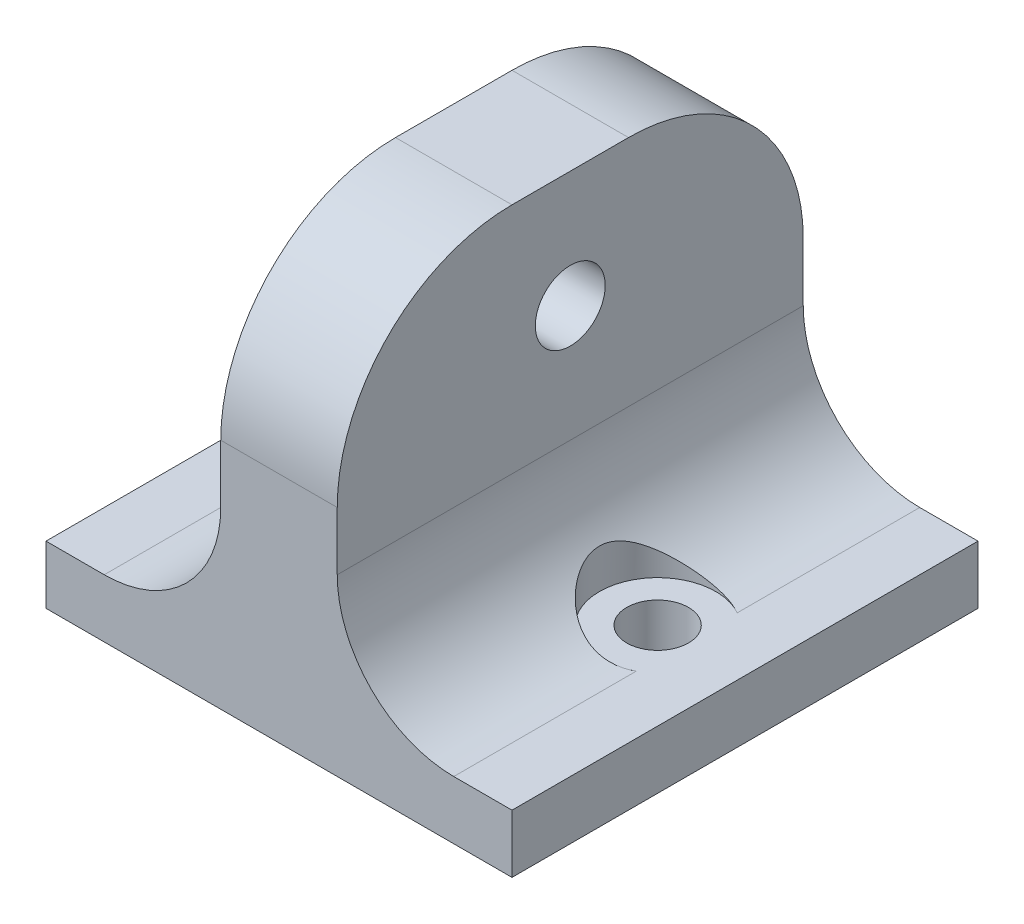
ISO-10303-21;
HEADER;
FILE_DESCRIPTION(('STEP AP214'),'2;1');
FILE_NAME('part.step','',(''),(''),'','','');
FILE_SCHEMA(('AUTOMOTIVE_DESIGN { 1 0 10303 214 1 1 1 1 }'));
ENDSEC;
DATA;
#1=APPLICATION_CONTEXT('core data for automotive mechanical design processes');
#2=APPLICATION_PROTOCOL_DEFINITION('international standard','automotive_design',2000,#1);
#3=PRODUCT_CONTEXT('',#1,'mechanical');
#4=PRODUCT('Part','Part','',(#3));
#5=PRODUCT_RELATED_PRODUCT_CATEGORY('part','',(#4));
#6=PRODUCT_DEFINITION_FORMATION('','',#4);
#7=PRODUCT_DEFINITION_CONTEXT('part definition',#1,'design');
#8=PRODUCT_DEFINITION('design','',#6,#7);
#9=PRODUCT_DEFINITION_SHAPE('','',#8);
#10=(LENGTH_UNIT() NAMED_UNIT(*) SI_UNIT(.MILLI.,.METRE.));
#11=(NAMED_UNIT(*) PLANE_ANGLE_UNIT() SI_UNIT($,.RADIAN.));
#12=(NAMED_UNIT(*) SI_UNIT($,.STERADIAN.) SOLID_ANGLE_UNIT());
#13=UNCERTAINTY_MEASURE_WITH_UNIT(LENGTH_MEASURE(1.E-05),#10,'distance_accuracy_value','');
#14=(GEOMETRIC_REPRESENTATION_CONTEXT(3) GLOBAL_UNCERTAINTY_ASSIGNED_CONTEXT((#13)) GLOBAL_UNIT_ASSIGNED_CONTEXT((#10,
#11,#12)) REPRESENTATION_CONTEXT('',''));
#15=CARTESIAN_POINT('',(0.,0.,0.));
#16=DIRECTION('',(0.,0.,1.));
#17=DIRECTION('',(1.,0.,0.));
#18=AXIS2_PLACEMENT_3D('',#15,#16,#17);
#19=CARTESIAN_POINT('',(15.,15.,20.));
#20=DIRECTION('',(0.,0.,-1.));
#21=DIRECTION('',(-1.,0.,0.));
#22=AXIS2_PLACEMENT_3D('',#19,#20,#21);
#23=CYLINDRICAL_SURFACE('',#22,10.);
#24=CARTESIAN_POINT('',(15.,5.,-4.3301270189222));
#25=CARTESIAN_POINT('',(14.8882386554781,4.99998445902274,-4.39467497557475));
#26=CARTESIAN_POINT('',(14.7739502263457,5.00187289688508,-4.45486764220656));
#27=CARTESIAN_POINT('',(14.5411776825015,5.00985678721763,-4.56620053854316));
#28=CARTESIAN_POINT('',(14.42269321766,5.01595259155152,-4.61734001067632));
#29=CARTESIAN_POINT('',(14.1826843035769,5.03273095738728,-4.71010620780674));
#30=CARTESIAN_POINT('',(14.0611675298457,5.04340286406892,-4.75175468840085));
#31=CARTESIAN_POINT('',(13.8157825421019,5.06959990142405,-4.82546611328692));
#32=CARTESIAN_POINT('',(13.6919145078616,5.08512466245134,-4.85752978729829));
#33=CARTESIAN_POINT('',(13.442663257165,5.12120575780032,-4.91199311729352));
#34=CARTESIAN_POINT('',(13.3172786541474,5.14176708942512,-4.9343831136626));
#35=CARTESIAN_POINT('',(13.0660426757909,5.18796002482518,-4.96947583630976));
#36=CARTESIAN_POINT('',(12.9401911435775,5.21359351983537,-4.98217494058438));
#37=CARTESIAN_POINT('',(12.6890702901284,5.26983289797169,-4.99800692406048));
#38=CARTESIAN_POINT('',(12.5638007078504,5.30043627315325,-5.00114461252506));
#39=CARTESIAN_POINT('',(12.3146058946927,5.36645013703068,-4.99811611266615));
#40=CARTESIAN_POINT('',(12.1906811982888,5.40186246639187,-4.99194635265744));
#41=CARTESIAN_POINT('',(11.9438958181217,5.47755139114533,-4.97053547828674));
#42=CARTESIAN_POINT('',(11.8210547183623,5.51786885801558,-4.95521330313223));
#43=CARTESIAN_POINT('',(11.5782561198452,5.60275343474998,-4.91584511122549));
#44=CARTESIAN_POINT('',(11.458299670397,5.64732206257535,-4.89179596967627));
#45=CARTESIAN_POINT('',(11.1036666935,5.78680572870925,-4.80720829959719));
#46=CARTESIAN_POINT('',(10.8741243109507,5.88753021950668,-4.73422005499128));
#47=CARTESIAN_POINT('',(10.4066319862622,6.11314613895848,-4.54845387781365));
#48=CARTESIAN_POINT('',(10.1708684173466,6.23948661008222,-4.43200579694301));
#49=CARTESIAN_POINT('',(9.7237129240917,6.50129806304623,-4.16652317086487));
#50=CARTESIAN_POINT('',(9.51234610001837,6.63677822509907,-4.01745551395287));
#51=CARTESIAN_POINT('',(9.19874806367569,6.85351098714008,-3.75821930389248));
#52=CARTESIAN_POINT('',(9.08772444898948,6.93385055803025,-3.65770366333628));
#53=CARTESIAN_POINT('',(8.87495331932355,7.0942092504585,-3.44694944624872));
#54=CARTESIAN_POINT('',(8.77320789010567,7.17422829609518,-3.33670869438988));
#55=CARTESIAN_POINT('',(8.57945897995814,7.33238715753747,-3.10676055742636));
#56=CARTESIAN_POINT('',(8.48745351404456,7.41052735373011,-2.98705510992714));
#57=CARTESIAN_POINT('',(8.31373504609715,7.56311658194494,-2.73828252034154));
#58=CARTESIAN_POINT('',(8.23201816602244,7.63756699828803,-2.60921893466744));
#59=CARTESIAN_POINT('',(8.04702621515732,7.81123675186426,-2.28457947505446));
#60=CARTESIAN_POINT('',(7.94940234396886,7.90749239303424,-2.08409613424456));
#61=CARTESIAN_POINT('',(7.77986212859192,8.08015208607802,-1.66469881137546));
#62=CARTESIAN_POINT('',(7.70789245105711,8.15659723118592,-1.44582424873336));
#63=CARTESIAN_POINT('',(7.60476755929538,8.26834201402342,-1.0355965473535));
#64=CARTESIAN_POINT('',(7.56844523859573,8.30870902075786,-0.846959267936247));
#65=CARTESIAN_POINT('',(7.51775975014223,8.36542447034214,-0.463257777180532));
#66=CARTESIAN_POINT('',(7.50337186978507,8.38179994262366,-0.268201051961923));
#67=CARTESIAN_POINT('',(7.49768003079177,8.38825085219856,0.123159524611976));
#68=CARTESIAN_POINT('',(7.50642945311698,8.37826547144377,0.319465215692312));
#69=CARTESIAN_POINT('',(7.54638064350427,8.33333681248906,0.706893995718618));
#70=CARTESIAN_POINT('',(7.57760536903189,8.29836801517505,0.898011577952599));
#71=CARTESIAN_POINT('',(7.67072752183493,8.1965023187875,1.31722703941873));
#72=CARTESIAN_POINT('',(7.73834596884302,8.12380473462324,1.54260804353444));
#73=CARTESIAN_POINT('',(7.90067535691012,7.95634285466991,1.97478863103345));
#74=CARTESIAN_POINT('',(7.99544977381622,7.86152695598049,2.18154316995849));
#75=CARTESIAN_POINT('',(8.17527792922302,7.69017718282131,2.51407179852844));
#76=CARTESIAN_POINT('',(8.25421460154454,7.61710640400181,2.64505888301143));
#77=CARTESIAN_POINT('',(8.42247654295923,7.46681364398052,2.89773190333771));
#78=CARTESIAN_POINT('',(8.51180551759454,7.38959018738542,3.01941449572691));
#79=CARTESIAN_POINT('',(8.70031130287036,7.23282730391278,3.25345371557601));
#80=CARTESIAN_POINT('',(8.7994957546746,7.15328611435021,3.36580298083358));
#81=CARTESIAN_POINT('',(9.00722922774176,6.99351091755676,3.58090807713066));
#82=CARTESIAN_POINT('',(9.11577716060494,6.91327699182176,3.68366502028666));
#83=CARTESIAN_POINT('',(9.34393218008002,6.752045244025,3.88102963149049));
#84=CARTESIAN_POINT('',(9.46370220360807,6.67105938493779,3.97545890203419));
#85=CARTESIAN_POINT('',(9.71225736460149,6.51108853070262,4.15353568833558));
#86=CARTESIAN_POINT('',(9.84104199568726,6.43210342350487,4.23718380895648));
#87=CARTESIAN_POINT('',(10.1070764026102,6.27744614002474,4.3929084470016));
#88=CARTESIAN_POINT('',(10.2443164428933,6.20177031901944,4.46499794067063));
#89=CARTESIAN_POINT('',(10.5268398931975,6.05482401481449,4.59683858797686));
#90=CARTESIAN_POINT('',(10.6721214869209,5.98355254446521,4.65659251347089));
#91=CARTESIAN_POINT('',(10.9428128660648,5.8590367777031,4.75309189096705));
#92=CARTESIAN_POINT('',(11.067016571347,5.80487483927991,4.79204598753907));
#93=CARTESIAN_POINT('',(11.3197502424476,5.70083738163116,4.86046727672747));
#94=CARTESIAN_POINT('',(11.4482794448191,5.65096111145303,4.88993613388198));
#95=CARTESIAN_POINT('',(11.7089199002316,5.55605936941798,4.93880161587832));
#96=CARTESIAN_POINT('',(11.8410291243882,5.51103121911383,4.95820382511786));
#97=CARTESIAN_POINT('',(12.1080599464991,5.42627020676107,4.98642217183202));
#98=CARTESIAN_POINT('',(12.2429815454031,5.3865373465007,4.99523830573167));
#99=CARTESIAN_POINT('',(12.5153770599518,5.31255086085722,5.00184176492424));
#100=CARTESIAN_POINT('',(12.6528607990511,5.27832784886097,4.99956952818582));
#101=CARTESIAN_POINT('',(12.9285128599414,5.21588477255241,4.98351640098273));
#102=CARTESIAN_POINT('',(13.066681126016,5.18766422762972,4.969736432364));
#103=CARTESIAN_POINT('',(13.3424666895532,5.13733181835263,4.9304808599491));
#104=CARTESIAN_POINT('',(13.4800840292886,5.11521947610297,4.90500617154303));
#105=CARTESIAN_POINT('',(13.7534216477177,5.07704190607821,4.84237565044302));
#106=CARTESIAN_POINT('',(13.8891424982343,5.06097481594874,4.80522342172068));
#107=CARTESIAN_POINT('',(14.1928109138574,5.03117922999928,4.70807859409246));
#108=CARTESIAN_POINT('',(14.3598518734793,5.01917562869394,4.64464921978264));
#109=CARTESIAN_POINT('',(14.6046305185433,5.00748388396129,4.53635362223853));
#110=CARTESIAN_POINT('',(14.6852208395975,5.00463875956758,4.498085530063));
#111=CARTESIAN_POINT('',(14.8442660821512,5.00089657029713,4.41728031927087));
#112=CARTESIAN_POINT('',(14.9227212776107,4.99999925432039,4.37474375166081));
#113=CARTESIAN_POINT('',(15.,5.,4.33012701892219));
#114=B_SPLINE_CURVE_WITH_KNOTS('',3,(#24,#25,#26,#27,#28,#29,#30,#31,#32,#33,#34,#35,#36,#37,
#38,#39,#40,#41,#42,#43,#44,#45,#46,#47,#48,#49,#50,#51,#52,#53,#54,#55,#56,#57,#58,#59,#60,#61,
#62,#63,#64,#65,#66,#67,#68,#69,#70,#71,#72,#73,#74,#75,#76,#77,#78,#79,#80,#81,#82,#83,#84,#85,
#86,#87,#88,#89,#90,#91,#92,#93,#94,#95,#96,#97,#98,#99,#100,#101,#102,#103,#104,#105,#106,#107,
#108,#109,#110,#111,#112,#113),.UNSPECIFIED.,.F.,.F.,(4,2,2,2,2,2,2,2,2,2,2,2,2,2,2,2,2,2,2,2,2,
2,2,2,2,2,2,2,2,2,2,2,2,2,2,2,2,2,2,2,2,2,2,2,4),(0.,0.387090916849162,0.77421421018411,
1.16044099361337,1.54663836497324,1.93322048598693,2.31994702269687,2.70647900904469,
3.09315936277963,3.48331631629536,3.87361310834647,4.65388774477208,5.52593271215405,
6.39886702154285,6.90827243696636,7.41779208728215,7.92720769785387,8.43643071765022,
9.16263926913818,9.88732915359624,10.4737624782751,11.0595346038483,11.6466593652476,
12.2343846995965,12.9692127756451,13.705772690227,14.2136590620486,14.7217270871772,
15.2301921484635,15.7385981858229,16.2560875413462,16.7735478511137,17.2904231059819,
17.8071820899648,18.2297277077615,18.6521991337308,19.0744359455757,19.4966729000116,
19.9211804212366,20.3456539398449,20.7700942389636,21.1944036739409,21.730247477374,
21.9979024822545,22.2655229805749),.UNSPECIFIED.);
#115=CARTESIAN_POINT('',(15.,5.,-4.33012701892219));
#116=VERTEX_POINT('',#115);
#117=CARTESIAN_POINT('',(15.,5.,4.33012701892219));
#118=VERTEX_POINT('',#117);
#119=EDGE_CURVE('E11',#116,#118,#114,.T.);
#120=ORIENTED_EDGE('',*,*,#119,.F.);
#121=DIRECTION('',(0.,0.,-1.));
#122=VECTOR('',#121,1.);
#123=CARTESIAN_POINT('',(15.,5.,0.));
#124=LINE('',#123,#122);
#125=CARTESIAN_POINT('',(15.,5.,-20.));
#126=VERTEX_POINT('',#125);
#127=EDGE_CURVE('E157',#126,#116,#124,.F.);
#128=ORIENTED_EDGE('',*,*,#127,.F.);
#129=CARTESIAN_POINT('',(15.,15.,-20.));
#130=DIRECTION('',(0.,0.,-1.));
#131=DIRECTION('',(-1.,0.,0.));
#132=AXIS2_PLACEMENT_3D('',#129,#130,#131);
#133=CIRCLE('',#132,10.);
#134=CARTESIAN_POINT('',(5.,15.,-20.));
#135=VERTEX_POINT('',#134);
#136=EDGE_CURVE('E176',#135,#126,#133,.F.);
#137=ORIENTED_EDGE('',*,*,#136,.F.);
#138=DIRECTION('',(0.,0.,-1.));
#139=VECTOR('',#138,1.);
#140=CARTESIAN_POINT('',(5.,15.,20.));
#141=LINE('',#140,#139);
#142=CARTESIAN_POINT('',(5.,15.,20.));
#143=VERTEX_POINT('',#142);
#144=EDGE_CURVE('E163',#143,#135,#141,.T.);
#145=ORIENTED_EDGE('',*,*,#144,.F.);
#146=CARTESIAN_POINT('',(15.,15.,20.));
#147=DIRECTION('',(0.,0.,-1.));
#148=DIRECTION('',(-1.,0.,0.));
#149=AXIS2_PLACEMENT_3D('',#146,#147,#148);
#150=CIRCLE('',#149,10.);
#151=CARTESIAN_POINT('',(15.,5.,20.));
#152=VERTEX_POINT('',#151);
#153=EDGE_CURVE('E162',#152,#143,#150,.T.);
#154=ORIENTED_EDGE('',*,*,#153,.F.);
#155=EDGE_CURVE('E154',#118,#152,#124,.F.);
#156=ORIENTED_EDGE('',*,*,#155,.F.);
#157=EDGE_LOOP('',(#120,#128,#137,#145,#154,#156));
#158=FACE_BOUND('',#157,.T.);
#159=ADVANCED_FACE('F37',(#158),#23,.F.);
#160=CARTESIAN_POINT('',(12.5,0.,0.));
#161=DIRECTION('',(0.,1.,0.));
#162=DIRECTION('',(0.,0.,1.));
#163=AXIS2_PLACEMENT_3D('',#160,#161,#162);
#164=CYLINDRICAL_SURFACE('',#163,2.65);
#165=CARTESIAN_POINT('',(12.5,0.,0.));
#166=DIRECTION('',(0.,1.,0.));
#167=DIRECTION('',(0.,0.,1.));
#168=AXIS2_PLACEMENT_3D('',#165,#166,#167);
#169=CIRCLE('',#168,2.65);
#170=CARTESIAN_POINT('',(12.5,0.,2.65));
#171=VERTEX_POINT('',#170);
#172=EDGE_CURVE('E485',#171,#171,#169,.T.);
#173=ORIENTED_EDGE('',*,*,#172,.F.);
#174=EDGE_LOOP('',(#173));
#175=FACE_BOUND('',#174,.T.);
#176=CARTESIAN_POINT('',(12.5,5.,0.));
#177=DIRECTION('',(0.,1.,0.));
#178=DIRECTION('',(0.,0.,1.));
#179=AXIS2_PLACEMENT_3D('',#176,#177,#178);
#180=CIRCLE('',#179,2.65);
#181=CARTESIAN_POINT('',(12.5,5.,2.65));
#182=VERTEX_POINT('',#181);
#183=EDGE_CURVE('E482',#182,#182,#180,.T.);
#184=ORIENTED_EDGE('',*,*,#183,.T.);
#185=EDGE_LOOP('',(#184));
#186=FACE_BOUND('',#185,.T.);
#187=ADVANCED_FACE('F192',(#175,#186),#164,.F.);
#188=CARTESIAN_POINT('',(-15.,15.,20.));
#189=DIRECTION('',(0.,0.,1.));
#190=DIRECTION('',(1.,0.,0.));
#191=AXIS2_PLACEMENT_3D('',#188,#189,#190);
#192=CYLINDRICAL_SURFACE('',#191,10.);
#193=CARTESIAN_POINT('',(-15.,5.,4.33012701892219));
#194=CARTESIAN_POINT('',(-14.8882386554781,4.99998445902274,4.39467497557475));
#195=CARTESIAN_POINT('',(-14.7739502263457,5.00187289688508,4.45486764220656));
#196=CARTESIAN_POINT('',(-14.5411776825015,5.00985678721763,4.56620053854315));
#197=CARTESIAN_POINT('',(-14.42269321766,5.01595259155152,4.61734001067632));
#198=CARTESIAN_POINT('',(-14.1826843035769,5.03273095738728,4.71010620780674));
#199=CARTESIAN_POINT('',(-14.0611675298457,5.04340286406892,4.75175468840085));
#200=CARTESIAN_POINT('',(-13.8157825421019,5.06959990142405,4.82546611328692));
#201=CARTESIAN_POINT('',(-13.6919145078616,5.08512466245134,4.85752978729829));
#202=CARTESIAN_POINT('',(-13.442663257165,5.12120575780032,4.91199311729352));
#203=CARTESIAN_POINT('',(-13.3172786541474,5.14176708942512,4.9343831136626));
#204=CARTESIAN_POINT('',(-13.0660426757909,5.18796002482518,4.96947583630976));
#205=CARTESIAN_POINT('',(-12.9401911435775,5.21359351983537,4.98217494058438));
#206=CARTESIAN_POINT('',(-12.6890702901284,5.26983289797169,4.99800692406048));
#207=CARTESIAN_POINT('',(-12.5638007078504,5.30043627315325,5.00114461252506));
#208=CARTESIAN_POINT('',(-12.3146058946927,5.36645013703068,4.99811611266615));
#209=CARTESIAN_POINT('',(-12.1906811982888,5.40186246639187,4.99194635265744));
#210=CARTESIAN_POINT('',(-11.9438958181217,5.47755139114533,4.97053547828674));
#211=CARTESIAN_POINT('',(-11.8210547183623,5.51786885801558,4.95521330313223));
#212=CARTESIAN_POINT('',(-11.5782561198452,5.60275343474998,4.91584511122549));
#213=CARTESIAN_POINT('',(-11.458299670397,5.64732206257535,4.89179596967627));
#214=CARTESIAN_POINT('',(-11.1036666935,5.78680572870925,4.80720829959719));
#215=CARTESIAN_POINT('',(-10.8741243109507,5.88753021950668,4.73422005499128));
#216=CARTESIAN_POINT('',(-10.4066319862622,6.11314613895848,4.54845387781365));
#217=CARTESIAN_POINT('',(-10.1708684173466,6.23948661008223,4.43200579694301));
#218=CARTESIAN_POINT('',(-9.7237129240917,6.50129806304623,4.16652317086486));
#219=CARTESIAN_POINT('',(-9.51234610001837,6.63677822509907,4.01745551395287));
#220=CARTESIAN_POINT('',(-9.19874806367569,6.85351098714008,3.75821930389248));
#221=CARTESIAN_POINT('',(-9.08772444898948,6.93385055803026,3.65770366333628));
#222=CARTESIAN_POINT('',(-8.87495331932355,7.09420925045851,3.44694944624872));
#223=CARTESIAN_POINT('',(-8.77320789010567,7.17422829609518,3.33670869438988));
#224=CARTESIAN_POINT('',(-8.57945897995814,7.33238715753747,3.10676055742635));
#225=CARTESIAN_POINT('',(-8.48745351404456,7.41052735373011,2.98705510992713));
#226=CARTESIAN_POINT('',(-8.31373504609715,7.56311658194494,2.73828252034154));
#227=CARTESIAN_POINT('',(-8.23201816602243,7.63756699828803,2.60921893466744));
#228=CARTESIAN_POINT('',(-8.04702621515732,7.81123675186426,2.28457947505446));
#229=CARTESIAN_POINT('',(-7.94940234396885,7.90749239303424,2.08409613424455));
#230=CARTESIAN_POINT('',(-7.77986212859192,8.08015208607802,1.66469881137546));
#231=CARTESIAN_POINT('',(-7.70789245105711,8.15659723118592,1.44582424873336));
#232=CARTESIAN_POINT('',(-7.60476755929538,8.26834201402342,1.03559654735349));
#233=CARTESIAN_POINT('',(-7.56844523859573,8.30870902075786,0.846959267936243));
#234=CARTESIAN_POINT('',(-7.51775975014223,8.36542447034214,0.463257777180528));
#235=CARTESIAN_POINT('',(-7.50337186978507,8.38179994262366,0.26820105196192));
#236=CARTESIAN_POINT('',(-7.49768003079177,8.38825085219856,-0.123159524611977));
#237=CARTESIAN_POINT('',(-7.50642945311698,8.37826547144377,-0.319465215692314));
#238=CARTESIAN_POINT('',(-7.54638064350427,8.33333681248906,-0.70689399571862));
#239=CARTESIAN_POINT('',(-7.57760536903189,8.29836801517505,-0.8980115779526));
#240=CARTESIAN_POINT('',(-7.67072752183493,8.1965023187875,-1.31722703941873));
#241=CARTESIAN_POINT('',(-7.73834596884302,8.12380473462324,-1.54260804353444));
#242=CARTESIAN_POINT('',(-7.90067535691012,7.95634285466991,-1.97478863103345));
#243=CARTESIAN_POINT('',(-7.99544977381622,7.86152695598049,-2.18154316995849));
#244=CARTESIAN_POINT('',(-8.17527792922302,7.69017718282131,-2.51407179852845));
#245=CARTESIAN_POINT('',(-8.25421460154454,7.61710640400181,-2.64505888301143));
#246=CARTESIAN_POINT('',(-8.42247654295923,7.46681364398052,-2.89773190333771));
#247=CARTESIAN_POINT('',(-8.51180551759454,7.38959018738541,-3.01941449572691));
#248=CARTESIAN_POINT('',(-8.70031130287036,7.23282730391278,-3.25345371557602));
#249=CARTESIAN_POINT('',(-8.79949575467459,7.15328611435021,-3.36580298083358));
#250=CARTESIAN_POINT('',(-9.00722922774176,6.99351091755676,-3.58090807713066));
#251=CARTESIAN_POINT('',(-9.11577716060494,6.91327699182176,-3.68366502028667));
#252=CARTESIAN_POINT('',(-9.34393218008002,6.752045244025,-3.88102963149049));
#253=CARTESIAN_POINT('',(-9.46370220360807,6.67105938493779,-3.97545890203419));
#254=CARTESIAN_POINT('',(-9.71225736460149,6.51108853070262,-4.15353568833558));
#255=CARTESIAN_POINT('',(-9.84104199568727,6.43210342350487,-4.23718380895648));
#256=CARTESIAN_POINT('',(-10.1070764026102,6.27744614002474,-4.39290844700161));
#257=CARTESIAN_POINT('',(-10.2443164428933,6.20177031901943,-4.46499794067063));
#258=CARTESIAN_POINT('',(-10.5268398931975,6.05482401481449,-4.59683858797686));
#259=CARTESIAN_POINT('',(-10.6721214869209,5.98355254446522,-4.6565925134709));
#260=CARTESIAN_POINT('',(-10.9428128660648,5.8590367777031,-4.75309189096705));
#261=CARTESIAN_POINT('',(-11.067016571347,5.80487483927991,-4.79204598753907));
#262=CARTESIAN_POINT('',(-11.3197502424476,5.70083738163116,-4.86046727672747));
#263=CARTESIAN_POINT('',(-11.4482794448191,5.65096111145303,-4.88993613388198));
#264=CARTESIAN_POINT('',(-11.7089199002316,5.55605936941798,-4.93880161587832));
#265=CARTESIAN_POINT('',(-11.8410291243882,5.51103121911383,-4.95820382511786));
#266=CARTESIAN_POINT('',(-12.1080599464991,5.42627020676106,-4.98642217183202));
#267=CARTESIAN_POINT('',(-12.2429815454031,5.3865373465007,-4.99523830573167));
#268=CARTESIAN_POINT('',(-12.5153770599518,5.31255086085722,-5.00184176492424));
#269=CARTESIAN_POINT('',(-12.6528607990511,5.27832784886097,-4.99956952818582));
#270=CARTESIAN_POINT('',(-12.9285128599414,5.21588477255241,-4.98351640098273));
#271=CARTESIAN_POINT('',(-13.066681126016,5.18766422762972,-4.969736432364));
#272=CARTESIAN_POINT('',(-13.3424666895532,5.13733181835263,-4.9304808599491));
#273=CARTESIAN_POINT('',(-13.4800840292886,5.11521947610297,-4.90500617154303));
#274=CARTESIAN_POINT('',(-13.7534216477177,5.07704190607821,-4.84237565044302));
#275=CARTESIAN_POINT('',(-13.8891424982343,5.06097481594874,-4.80522342172067));
#276=CARTESIAN_POINT('',(-14.1928109138574,5.03117922999928,-4.70807859409246));
#277=CARTESIAN_POINT('',(-14.3598518734793,5.01917562869395,-4.64464921978264));
#278=CARTESIAN_POINT('',(-14.6046305185433,5.00748388396129,-4.53635362223854));
#279=CARTESIAN_POINT('',(-14.6852208395975,5.00463875956757,-4.498085530063));
#280=CARTESIAN_POINT('',(-14.8442660821512,5.00089657029713,-4.41728031927087));
#281=CARTESIAN_POINT('',(-14.9227212776107,4.99999925432039,-4.37474375166081));
#282=CARTESIAN_POINT('',(-15.,5.,-4.33012701892219));
#283=B_SPLINE_CURVE_WITH_KNOTS('',3,(#193,#194,#195,#196,#197,#198,#199,#200,#201,#202,#203,
#204,#205,#206,#207,#208,#209,#210,#211,#212,#213,#214,#215,#216,#217,#218,#219,#220,#221,#222,
#223,#224,#225,#226,#227,#228,#229,#230,#231,#232,#233,#234,#235,#236,#237,#238,#239,#240,#241,
#242,#243,#244,#245,#246,#247,#248,#249,#250,#251,#252,#253,#254,#255,#256,#257,#258,#259,#260,
#261,#262,#263,#264,#265,#266,#267,#268,#269,#270,#271,#272,#273,#274,#275,#276,#277,#278,#279,
#280,#281,#282),.UNSPECIFIED.,.F.,.F.,(4,2,2,2,2,2,2,2,2,2,2,2,2,2,2,2,2,2,2,2,2,2,2,2,2,2,2,2,
2,2,2,2,2,2,2,2,2,2,2,2,2,2,2,2,4),(0.,0.387090916849162,0.774214210184112,1.16044099361338,
1.54663836497325,1.93322048598694,2.31994702269688,2.7064790090447,3.09315936277964,
3.48331631629537,3.87361310834647,4.65388774477209,5.52593271215406,6.39886702154286,
6.90827243696636,7.41779208728215,7.92720769785388,8.43643071765023,9.16263926913819,
9.88732915359625,10.4737624782751,11.0595346038483,11.6466593652476,12.2343846995965,
12.9692127756451,13.705772690227,14.2136590620487,14.7217270871772,15.2301921484635,
15.7385981858229,16.2560875413462,16.7735478511137,17.2904231059819,17.8071820899648,
18.2297277077615,18.6521991337308,19.0744359455757,19.4966729000116,19.9211804212366,
20.3456539398449,20.7700942389636,21.1944036739409,21.730247477374,21.9979024822545,
22.2655229805749),.UNSPECIFIED.);
#284=CARTESIAN_POINT('',(-15.,5.,4.33012701892219));
#285=VERTEX_POINT('',#284);
#286=CARTESIAN_POINT('',(-15.,5.,-4.33012701892219));
#287=VERTEX_POINT('',#286);
#288=EDGE_CURVE('E50',#285,#287,#283,.T.);
#289=ORIENTED_EDGE('',*,*,#288,.F.);
#290=DIRECTION('',(0.,0.,1.));
#291=VECTOR('',#290,1.);
#292=CARTESIAN_POINT('',(-15.,5.,0.));
#293=LINE('',#292,#291);
#294=CARTESIAN_POINT('',(-15.,5.,20.));
#295=VERTEX_POINT('',#294);
#296=EDGE_CURVE('E173',#295,#285,#293,.F.);
#297=ORIENTED_EDGE('',*,*,#296,.F.);
#298=CARTESIAN_POINT('',(-15.,15.,20.));
#299=DIRECTION('',(0.,0.,-1.));
#300=DIRECTION('',(-1.,0.,0.));
#301=AXIS2_PLACEMENT_3D('',#298,#299,#300);
#302=CIRCLE('',#301,10.);
#303=CARTESIAN_POINT('',(-5.,15.,20.));
#304=VERTEX_POINT('',#303);
#305=EDGE_CURVE('E57',#304,#295,#302,.T.);
#306=ORIENTED_EDGE('',*,*,#305,.F.);
#307=DIRECTION('',(0.,0.,1.));
#308=VECTOR('',#307,1.);
#309=CARTESIAN_POINT('',(-5.,15.,20.));
#310=LINE('',#309,#308);
#311=CARTESIAN_POINT('',(-5.,15.,-20.));
#312=VERTEX_POINT('',#311);
#313=EDGE_CURVE('E165',#312,#304,#310,.T.);
#314=ORIENTED_EDGE('',*,*,#313,.F.);
#315=CARTESIAN_POINT('',(-15.,15.,-20.));
#316=DIRECTION('',(0.,0.,-1.));
#317=DIRECTION('',(-1.,0.,0.));
#318=AXIS2_PLACEMENT_3D('',#315,#316,#317);
#319=CIRCLE('',#318,10.);
#320=CARTESIAN_POINT('',(-15.,5.,-20.));
#321=VERTEX_POINT('',#320);
#322=EDGE_CURVE('E180',#321,#312,#319,.F.);
#323=ORIENTED_EDGE('',*,*,#322,.F.);
#324=EDGE_CURVE('E65',#287,#321,#293,.F.);
#325=ORIENTED_EDGE('',*,*,#324,.F.);
#326=EDGE_LOOP('',(#289,#297,#306,#314,#323,#325));
#327=FACE_BOUND('',#326,.T.);
#328=ADVANCED_FACE('F39',(#327),#192,.F.);
#329=CARTESIAN_POINT('',(-12.5,0.,0.));
#330=DIRECTION('',(0.,1.,0.));
#331=DIRECTION('',(0.,0.,1.));
#332=AXIS2_PLACEMENT_3D('',#329,#330,#331);
#333=CYLINDRICAL_SURFACE('',#332,2.65);
#334=CARTESIAN_POINT('',(-12.5,0.,0.));
#335=DIRECTION('',(0.,1.,0.));
#336=DIRECTION('',(0.,0.,1.));
#337=AXIS2_PLACEMENT_3D('',#334,#335,#336);
#338=CIRCLE('',#337,2.65);
#339=CARTESIAN_POINT('',(-12.5,0.,2.65));
#340=VERTEX_POINT('',#339);
#341=EDGE_CURVE('E479',#340,#340,#338,.T.);
#342=ORIENTED_EDGE('',*,*,#341,.F.);
#343=EDGE_LOOP('',(#342));
#344=FACE_BOUND('',#343,.T.);
#345=CARTESIAN_POINT('',(-12.5,5.,0.));
#346=DIRECTION('',(0.,1.,0.));
#347=DIRECTION('',(0.,0.,1.));
#348=AXIS2_PLACEMENT_3D('',#345,#346,#347);
#349=CIRCLE('',#348,2.65);
#350=CARTESIAN_POINT('',(-12.5,5.,2.65));
#351=VERTEX_POINT('',#350);
#352=EDGE_CURVE('E476',#351,#351,#349,.T.);
#353=ORIENTED_EDGE('',*,*,#352,.T.);
#354=EDGE_LOOP('',(#353));
#355=FACE_BOUND('',#354,.T.);
#356=ADVANCED_FACE('F196',(#344,#355),#333,.F.);
#357=CARTESIAN_POINT('',(0.,5.,0.));
#358=DIRECTION('',(0.,1.,0.));
#359=DIRECTION('',(0.,0.,1.));
#360=AXIS2_PLACEMENT_3D('',#357,#358,#359);
#361=PLANE('',#360);
#362=ORIENTED_EDGE('',*,*,#127,.T.);
#363=CARTESIAN_POINT('',(12.5,5.,0.));
#364=DIRECTION('',(0.,1.,0.));
#365=DIRECTION('',(0.,0.,1.));
#366=AXIS2_PLACEMENT_3D('',#363,#364,#365);
#367=CIRCLE('',#366,5.);
#368=EDGE_CURVE('E146',#116,#118,#367,.T.);
#369=ORIENTED_EDGE('',*,*,#368,.T.);
#370=ORIENTED_EDGE('',*,*,#155,.T.);
#371=DIRECTION('',(1.,0.,0.));
#372=VECTOR('',#371,1.);
#373=CARTESIAN_POINT('',(0.,5.,20.));
#374=LINE('',#373,#372);
#375=CARTESIAN_POINT('',(20.,5.,20.));
#376=VERTEX_POINT('',#375);
#377=EDGE_CURVE('E386',#152,#376,#374,.T.);
#378=ORIENTED_EDGE('',*,*,#377,.T.);
#379=DIRECTION('',(0.,0.,1.));
#380=VECTOR('',#379,1.);
#381=CARTESIAN_POINT('',(20.,5.,0.));
#382=LINE('',#381,#380);
#383=CARTESIAN_POINT('',(20.,5.,-20.));
#384=VERTEX_POINT('',#383);
#385=EDGE_CURVE('E404',#384,#376,#382,.T.);
#386=ORIENTED_EDGE('',*,*,#385,.F.);
#387=DIRECTION('',(1.,0.,0.));
#388=VECTOR('',#387,1.);
#389=CARTESIAN_POINT('',(0.,5.,-20.));
#390=LINE('',#389,#388);
#391=EDGE_CURVE('E463',#126,#384,#390,.T.);
#392=ORIENTED_EDGE('',*,*,#391,.F.);
#393=EDGE_LOOP('',(#362,#369,#370,#378,#386,#392));
#394=FACE_BOUND('',#393,.T.);
#395=ORIENTED_EDGE('',*,*,#183,.F.);
#396=EDGE_LOOP('',(#395));
#397=FACE_BOUND('',#396,.T.);
#398=ADVANCED_FACE('F152',(#394,#397),#361,.T.);
#399=CARTESIAN_POINT('',(20.,5.,0.));
#400=DIRECTION('',(1.,0.,0.));
#401=DIRECTION('',(0.,0.,-1.));
#402=AXIS2_PLACEMENT_3D('',#399,#400,#401);
#403=PLANE('',#402);
#404=DIRECTION('',(0.,0.,1.));
#405=VECTOR('',#404,1.);
#406=CARTESIAN_POINT('',(20.,0.,0.));
#407=LINE('',#406,#405);
#408=CARTESIAN_POINT('',(20.,0.,-20.));
#409=VERTEX_POINT('',#408);
#410=CARTESIAN_POINT('',(20.,0.,20.));
#411=VERTEX_POINT('',#410);
#412=EDGE_CURVE('E393',#409,#411,#407,.T.);
#413=ORIENTED_EDGE('',*,*,#412,.F.);
#414=DIRECTION('',(0.,-1.,0.));
#415=VECTOR('',#414,1.);
#416=CARTESIAN_POINT('',(20.,5.,-20.));
#417=LINE('',#416,#415);
#418=EDGE_CURVE('E409',#384,#409,#417,.T.);
#419=ORIENTED_EDGE('',*,*,#418,.F.);
#420=ORIENTED_EDGE('',*,*,#385,.T.);
#421=DIRECTION('',(0.,-1.,0.));
#422=VECTOR('',#421,1.);
#423=CARTESIAN_POINT('',(20.,5.,20.));
#424=LINE('',#423,#422);
#425=EDGE_CURVE('E385',#376,#411,#424,.T.);
#426=ORIENTED_EDGE('',*,*,#425,.T.);
#427=EDGE_LOOP('',(#413,#419,#420,#426));
#428=FACE_BOUND('',#427,.T.);
#429=ADVANCED_FACE('F234',(#428),#403,.T.);
#430=CARTESIAN_POINT('',(0.,5.,-20.));
#431=DIRECTION('',(0.,0.,-1.));
#432=DIRECTION('',(-1.,0.,0.));
#433=AXIS2_PLACEMENT_3D('',#430,#431,#432);
#434=PLANE('',#433);
#435=DIRECTION('',(0.,-1.,0.));
#436=VECTOR('',#435,1.);
#437=CARTESIAN_POINT('',(-5.,35.,-20.));
#438=LINE('',#437,#436);
#439=CARTESIAN_POINT('',(-5.,20.,-20.));
#440=VERTEX_POINT('',#439);
#441=EDGE_CURVE('E443',#440,#312,#438,.T.);
#442=ORIENTED_EDGE('',*,*,#441,.F.);
#443=DIRECTION('',(-1.,0.,0.));
#444=VECTOR('',#443,1.);
#445=CARTESIAN_POINT('',(5.,20.,-20.));
#446=LINE('',#445,#444);
#447=CARTESIAN_POINT('',(5.,20.,-20.));
#448=VERTEX_POINT('',#447);
#449=EDGE_CURVE('E426',#440,#448,#446,.F.);
#450=ORIENTED_EDGE('',*,*,#449,.T.);
#451=DIRECTION('',(0.,-1.,0.));
#452=VECTOR('',#451,1.);
#453=CARTESIAN_POINT('',(5.,35.,-20.));
#454=LINE('',#453,#452);
#455=EDGE_CURVE('E397',#448,#135,#454,.T.);
#456=ORIENTED_EDGE('',*,*,#455,.T.);
#457=ORIENTED_EDGE('',*,*,#136,.T.);
#458=ORIENTED_EDGE('',*,*,#391,.T.);
#459=ORIENTED_EDGE('',*,*,#418,.T.);
#460=DIRECTION('',(1.,0.,0.));
#461=VECTOR('',#460,1.);
#462=CARTESIAN_POINT('',(0.,0.,-20.));
#463=LINE('',#462,#461);
#464=CARTESIAN_POINT('',(-20.,0.,-20.));
#465=VERTEX_POINT('',#464);
#466=EDGE_CURVE('E396',#465,#409,#463,.T.);
#467=ORIENTED_EDGE('',*,*,#466,.F.);
#468=DIRECTION('',(0.,-1.,0.));
#469=VECTOR('',#468,1.);
#470=CARTESIAN_POINT('',(-20.,5.,-20.));
#471=LINE('',#470,#469);
#472=CARTESIAN_POINT('',(-20.,5.,-20.));
#473=VERTEX_POINT('',#472);
#474=EDGE_CURVE('E407',#473,#465,#471,.T.);
#475=ORIENTED_EDGE('',*,*,#474,.F.);
#476=EDGE_CURVE('E464',#473,#321,#390,.T.);
#477=ORIENTED_EDGE('',*,*,#476,.T.);
#478=ORIENTED_EDGE('',*,*,#322,.T.);
#479=EDGE_LOOP('',(#442,#450,#456,#457,#458,#459,#467,#475,#477,#478));
#480=FACE_BOUND('',#479,.T.);
#481=ADVANCED_FACE('F230',(#480),#434,.T.);
#482=CARTESIAN_POINT('',(-20.,5.,0.));
#483=DIRECTION('',(1.,0.,0.));
#484=DIRECTION('',(0.,0.,-1.));
#485=AXIS2_PLACEMENT_3D('',#482,#483,#484);
#486=PLANE('',#485);
#487=DIRECTION('',(0.,0.,1.));
#488=VECTOR('',#487,1.);
#489=CARTESIAN_POINT('',(-20.,0.,0.));
#490=LINE('',#489,#488);
#491=CARTESIAN_POINT('',(-20.,0.,20.));
#492=VERTEX_POINT('',#491);
#493=EDGE_CURVE('E400',#465,#492,#490,.T.);
#494=ORIENTED_EDGE('',*,*,#493,.T.);
#495=DIRECTION('',(0.,-1.,0.));
#496=VECTOR('',#495,1.);
#497=CARTESIAN_POINT('',(-20.,5.,20.));
#498=LINE('',#497,#496);
#499=CARTESIAN_POINT('',(-20.,5.,20.));
#500=VERTEX_POINT('',#499);
#501=EDGE_CURVE('E388',#500,#492,#498,.T.);
#502=ORIENTED_EDGE('',*,*,#501,.F.);
#503=DIRECTION('',(0.,0.,1.));
#504=VECTOR('',#503,1.);
#505=CARTESIAN_POINT('',(-20.,5.,0.));
#506=LINE('',#505,#504);
#507=EDGE_CURVE('E382',#473,#500,#506,.T.);
#508=ORIENTED_EDGE('',*,*,#507,.F.);
#509=ORIENTED_EDGE('',*,*,#474,.T.);
#510=EDGE_LOOP('',(#494,#502,#508,#509));
#511=FACE_BOUND('',#510,.T.);
#512=ADVANCED_FACE('F227',(#511),#486,.F.);
#513=CARTESIAN_POINT('',(0.,5.,20.));
#514=DIRECTION('',(0.,0.,-1.));
#515=DIRECTION('',(-1.,0.,0.));
#516=AXIS2_PLACEMENT_3D('',#513,#514,#515);
#517=PLANE('',#516);
#518=DIRECTION('',(0.,-1.,0.));
#519=VECTOR('',#518,1.);
#520=CARTESIAN_POINT('',(5.,35.,20.));
#521=LINE('',#520,#519);
#522=CARTESIAN_POINT('',(5.,20.,20.));
#523=VERTEX_POINT('',#522);
#524=EDGE_CURVE('E436',#523,#143,#521,.T.);
#525=ORIENTED_EDGE('',*,*,#524,.F.);
#526=DIRECTION('',(1.,0.,0.));
#527=VECTOR('',#526,1.);
#528=CARTESIAN_POINT('',(0.,20.,20.));
#529=LINE('',#528,#527);
#530=CARTESIAN_POINT('',(-5.,20.,20.));
#531=VERTEX_POINT('',#530);
#532=EDGE_CURVE('E167',#523,#531,#529,.F.);
#533=ORIENTED_EDGE('',*,*,#532,.T.);
#534=DIRECTION('',(0.,-1.,0.));
#535=VECTOR('',#534,1.);
#536=CARTESIAN_POINT('',(-5.,35.,20.));
#537=LINE('',#536,#535);
#538=EDGE_CURVE('E434',#531,#304,#537,.T.);
#539=ORIENTED_EDGE('',*,*,#538,.T.);
#540=ORIENTED_EDGE('',*,*,#305,.T.);
#541=EDGE_CURVE('E380',#500,#295,#374,.T.);
#542=ORIENTED_EDGE('',*,*,#541,.F.);
#543=ORIENTED_EDGE('',*,*,#501,.T.);
#544=DIRECTION('',(1.,0.,0.));
#545=VECTOR('',#544,1.);
#546=CARTESIAN_POINT('',(0.,0.,20.));
#547=LINE('',#546,#545);
#548=EDGE_CURVE('E402',#492,#411,#547,.T.);
#549=ORIENTED_EDGE('',*,*,#548,.T.);
#550=ORIENTED_EDGE('',*,*,#425,.F.);
#551=ORIENTED_EDGE('',*,*,#377,.F.);
#552=ORIENTED_EDGE('',*,*,#153,.T.);
#553=EDGE_LOOP('',(#525,#533,#539,#540,#542,#543,#549,#550,#551,#552));
#554=FACE_BOUND('',#553,.T.);
#555=ADVANCED_FACE('F221',(#554),#517,.F.);
#556=ORIENTED_EDGE('',*,*,#296,.T.);
#557=CARTESIAN_POINT('',(-12.5,5.,0.));
#558=DIRECTION('',(0.,1.,0.));
#559=DIRECTION('',(0.,0.,1.));
#560=AXIS2_PLACEMENT_3D('',#557,#558,#559);
#561=CIRCLE('',#560,5.);
#562=EDGE_CURVE('E158',#285,#287,#561,.T.);
#563=ORIENTED_EDGE('',*,*,#562,.T.);
#564=ORIENTED_EDGE('',*,*,#324,.T.);
#565=ORIENTED_EDGE('',*,*,#476,.F.);
#566=ORIENTED_EDGE('',*,*,#507,.T.);
#567=ORIENTED_EDGE('',*,*,#541,.T.);
#568=EDGE_LOOP('',(#556,#563,#564,#565,#566,#567));
#569=FACE_BOUND('',#568,.T.);
#570=ORIENTED_EDGE('',*,*,#352,.F.);
#571=EDGE_LOOP('',(#570));
#572=FACE_BOUND('',#571,.T.);
#573=ADVANCED_FACE('F218',(#569,#572),#361,.T.);
#574=CARTESIAN_POINT('',(0.,0.,0.));
#575=DIRECTION('',(0.,1.,0.));
#576=DIRECTION('',(0.,0.,1.));
#577=AXIS2_PLACEMENT_3D('',#574,#575,#576);
#578=PLANE('',#577);
#579=ORIENTED_EDGE('',*,*,#172,.T.);
#580=EDGE_LOOP('',(#579));
#581=FACE_BOUND('',#580,.T.);
#582=ORIENTED_EDGE('',*,*,#341,.T.);
#583=EDGE_LOOP('',(#582));
#584=FACE_BOUND('',#583,.T.);
#585=ORIENTED_EDGE('',*,*,#412,.T.);
#586=ORIENTED_EDGE('',*,*,#548,.F.);
#587=ORIENTED_EDGE('',*,*,#493,.F.);
#588=ORIENTED_EDGE('',*,*,#466,.T.);
#589=EDGE_LOOP('',(#585,#586,#587,#588));
#590=FACE_BOUND('',#589,.T.);
#591=ADVANCED_FACE('F216',(#581,#584,#590),#578,.F.);
#592=CARTESIAN_POINT('',(5.,35.,20.));
#593=DIRECTION('',(-1.,0.,0.));
#594=DIRECTION('',(0.,0.,1.));
#595=AXIS2_PLACEMENT_3D('',#592,#593,#594);
#596=PLANE('',#595);
#597=CARTESIAN_POINT('',(5.,25.,0.));
#598=DIRECTION('',(1.,0.,0.));
#599=DIRECTION('',(0.,0.,-1.));
#600=AXIS2_PLACEMENT_3D('',#597,#598,#599);
#601=CIRCLE('',#600,3.);
#602=CARTESIAN_POINT('',(5.,25.,-3.));
#603=VERTEX_POINT('',#602);
#604=EDGE_CURVE('E416',#603,#603,#601,.T.);
#605=ORIENTED_EDGE('',*,*,#604,.F.);
#606=EDGE_LOOP('',(#605));
#607=FACE_BOUND('',#606,.T.);
#608=ORIENTED_EDGE('',*,*,#524,.T.);
#609=ORIENTED_EDGE('',*,*,#144,.T.);
#610=ORIENTED_EDGE('',*,*,#455,.F.);
#611=CARTESIAN_POINT('',(5.,20.,-5.));
#612=DIRECTION('',(-1.,0.,0.));
#613=DIRECTION('',(0.,0.,1.));
#614=AXIS2_PLACEMENT_3D('',#611,#612,#613);
#615=CIRCLE('',#614,15.);
#616=CARTESIAN_POINT('',(5.,35.,-5.));
#617=VERTEX_POINT('',#616);
#618=EDGE_CURVE('E430',#448,#617,#615,.F.);
#619=ORIENTED_EDGE('',*,*,#618,.T.);
#620=DIRECTION('',(0.,0.,-1.));
#621=VECTOR('',#620,1.);
#622=CARTESIAN_POINT('',(5.,35.,20.));
#623=LINE('',#622,#621);
#624=CARTESIAN_POINT('',(5.,35.,5.));
#625=VERTEX_POINT('',#624);
#626=EDGE_CURVE('E415',#625,#617,#623,.T.);
#627=ORIENTED_EDGE('',*,*,#626,.F.);
#628=CARTESIAN_POINT('',(5.,20.,5.));
#629=DIRECTION('',(-1.,0.,0.));
#630=DIRECTION('',(0.,0.,1.));
#631=AXIS2_PLACEMENT_3D('',#628,#629,#630);
#632=CIRCLE('',#631,15.);
#633=EDGE_CURVE('E428',#625,#523,#632,.F.);
#634=ORIENTED_EDGE('',*,*,#633,.T.);
#635=EDGE_LOOP('',(#608,#609,#610,#619,#627,#634));
#636=FACE_BOUND('',#635,.T.);
#637=ADVANCED_FACE('F212',(#607,#636),#596,.F.);
#638=CARTESIAN_POINT('',(-5.,35.,20.));
#639=DIRECTION('',(1.,0.,0.));
#640=DIRECTION('',(0.,0.,-1.));
#641=AXIS2_PLACEMENT_3D('',#638,#639,#640);
#642=PLANE('',#641);
#643=CARTESIAN_POINT('',(-5.,25.,0.));
#644=DIRECTION('',(1.,0.,0.));
#645=DIRECTION('',(0.,0.,-1.));
#646=AXIS2_PLACEMENT_3D('',#643,#644,#645);
#647=CIRCLE('',#646,3.);
#648=CARTESIAN_POINT('',(-5.,25.,-3.));
#649=VERTEX_POINT('',#648);
#650=EDGE_CURVE('E412',#649,#649,#647,.T.);
#651=ORIENTED_EDGE('',*,*,#650,.T.);
#652=EDGE_LOOP('',(#651));
#653=FACE_BOUND('',#652,.T.);
#654=ORIENTED_EDGE('',*,*,#441,.T.);
#655=ORIENTED_EDGE('',*,*,#313,.T.);
#656=ORIENTED_EDGE('',*,*,#538,.F.);
#657=CARTESIAN_POINT('',(-5.,20.,5.));
#658=DIRECTION('',(1.,0.,0.));
#659=DIRECTION('',(0.,0.,-1.));
#660=AXIS2_PLACEMENT_3D('',#657,#658,#659);
#661=CIRCLE('',#660,15.);
#662=CARTESIAN_POINT('',(-5.,35.,5.));
#663=VERTEX_POINT('',#662);
#664=EDGE_CURVE('E422',#531,#663,#661,.F.);
#665=ORIENTED_EDGE('',*,*,#664,.T.);
#666=DIRECTION('',(0.,0.,1.));
#667=VECTOR('',#666,1.);
#668=CARTESIAN_POINT('',(-5.,35.,20.));
#669=LINE('',#668,#667);
#670=CARTESIAN_POINT('',(-5.,35.,-5.));
#671=VERTEX_POINT('',#670);
#672=EDGE_CURVE('E449',#671,#663,#669,.T.);
#673=ORIENTED_EDGE('',*,*,#672,.F.);
#674=CARTESIAN_POINT('',(-5.,20.,-5.));
#675=DIRECTION('',(1.,0.,0.));
#676=DIRECTION('',(0.,0.,-1.));
#677=AXIS2_PLACEMENT_3D('',#674,#675,#676);
#678=CIRCLE('',#677,15.);
#679=EDGE_CURVE('E424',#671,#440,#678,.F.);
#680=ORIENTED_EDGE('',*,*,#679,.T.);
#681=EDGE_LOOP('',(#654,#655,#656,#665,#673,#680));
#682=FACE_BOUND('',#681,.T.);
#683=ADVANCED_FACE('F208',(#653,#682),#642,.F.);
#684=CARTESIAN_POINT('',(0.,35.,0.));
#685=DIRECTION('',(0.,-1.,0.));
#686=DIRECTION('',(0.,0.,-1.));
#687=AXIS2_PLACEMENT_3D('',#684,#685,#686);
#688=PLANE('',#687);
#689=ORIENTED_EDGE('',*,*,#626,.T.);
#690=DIRECTION('',(-1.,0.,0.));
#691=VECTOR('',#690,1.);
#692=CARTESIAN_POINT('',(-5.,35.,-5.));
#693=LINE('',#692,#691);
#694=EDGE_CURVE('E419',#617,#671,#693,.T.);
#695=ORIENTED_EDGE('',*,*,#694,.T.);
#696=ORIENTED_EDGE('',*,*,#672,.T.);
#697=DIRECTION('',(1.,0.,0.));
#698=VECTOR('',#697,1.);
#699=CARTESIAN_POINT('',(0.,35.,5.));
#700=LINE('',#699,#698);
#701=EDGE_CURVE('E411',#663,#625,#700,.T.);
#702=ORIENTED_EDGE('',*,*,#701,.T.);
#703=EDGE_LOOP('',(#689,#695,#696,#702));
#704=FACE_BOUND('',#703,.T.);
#705=ADVANCED_FACE('F204',(#704),#688,.F.);
#706=CARTESIAN_POINT('',(-20.,25.,0.));
#707=DIRECTION('',(1.,0.,0.));
#708=DIRECTION('',(0.,0.,-1.));
#709=AXIS2_PLACEMENT_3D('',#706,#707,#708);
#710=CYLINDRICAL_SURFACE('',#709,3.);
#711=ORIENTED_EDGE('',*,*,#604,.T.);
#712=EDGE_LOOP('',(#711));
#713=FACE_BOUND('',#712,.T.);
#714=ORIENTED_EDGE('',*,*,#650,.F.);
#715=EDGE_LOOP('',(#714));
#716=FACE_BOUND('',#715,.T.);
#717=ADVANCED_FACE('F200',(#713,#716),#710,.F.);
#718=CARTESIAN_POINT('',(0.,20.,-5.));
#719=DIRECTION('',(1.,0.,0.));
#720=DIRECTION('',(0.,0.,-1.));
#721=AXIS2_PLACEMENT_3D('',#718,#719,#720);
#722=CYLINDRICAL_SURFACE('',#721,15.);
#723=ORIENTED_EDGE('',*,*,#618,.F.);
#724=ORIENTED_EDGE('',*,*,#449,.F.);
#725=ORIENTED_EDGE('',*,*,#679,.F.);
#726=ORIENTED_EDGE('',*,*,#694,.F.);
#727=EDGE_LOOP('',(#723,#724,#725,#726));
#728=FACE_BOUND('',#727,.T.);
#729=ADVANCED_FACE('F203',(#728),#722,.T.);
#730=CARTESIAN_POINT('',(0.,20.,5.));
#731=DIRECTION('',(1.,0.,0.));
#732=DIRECTION('',(0.,0.,-1.));
#733=AXIS2_PLACEMENT_3D('',#730,#731,#732);
#734=CYLINDRICAL_SURFACE('',#733,15.);
#735=ORIENTED_EDGE('',*,*,#664,.F.);
#736=ORIENTED_EDGE('',*,*,#532,.F.);
#737=ORIENTED_EDGE('',*,*,#633,.F.);
#738=ORIENTED_EDGE('',*,*,#701,.F.);
#739=EDGE_LOOP('',(#735,#736,#737,#738));
#740=FACE_BOUND('',#739,.T.);
#741=ADVANCED_FACE('F189',(#740),#734,.T.);
#742=CARTESIAN_POINT('',(-12.5,35.,0.));
#743=DIRECTION('',(0.,-1.,0.));
#744=DIRECTION('',(0.,0.,-1.));
#745=AXIS2_PLACEMENT_3D('',#742,#743,#744);
#746=CYLINDRICAL_SURFACE('',#745,5.);
#747=ORIENTED_EDGE('',*,*,#288,.T.);
#748=ORIENTED_EDGE('',*,*,#562,.F.);
#749=EDGE_LOOP('',(#747,#748));
#750=FACE_BOUND('',#749,.T.);
#751=ADVANCED_FACE('F185',(#750),#746,.F.);
#752=CARTESIAN_POINT('',(12.5,35.,0.));
#753=DIRECTION('',(0.,-1.,0.));
#754=DIRECTION('',(0.,0.,-1.));
#755=AXIS2_PLACEMENT_3D('',#752,#753,#754);
#756=CYLINDRICAL_SURFACE('',#755,5.);
#757=ORIENTED_EDGE('',*,*,#119,.T.);
#758=ORIENTED_EDGE('',*,*,#368,.F.);
#759=EDGE_LOOP('',(#757,#758));
#760=FACE_BOUND('',#759,.T.);
#761=ADVANCED_FACE('F145',(#760),#756,.F.);
#762=CLOSED_SHELL('',(#159,#187,#328,#356,#398,#429,#481,#512,#555,#573,#591,#637,#683,#705,
#717,#729,#741,#751,#761));
#763=MANIFOLD_SOLID_BREP('B2',#762);
#764=ADVANCED_BREP_SHAPE_REPRESENTATION('',(#18,#763),#14);
#765=SHAPE_DEFINITION_REPRESENTATION(#9,#764);
ENDSEC;
END-ISO-10303-21;
